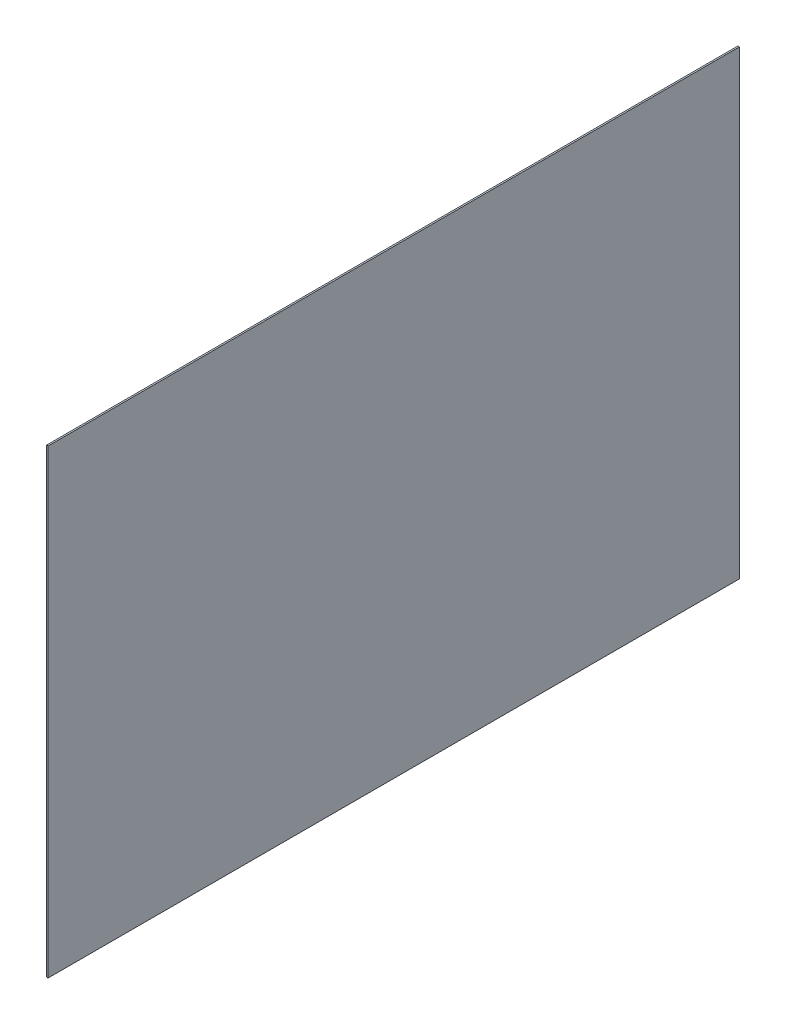
ISO-10303-21;
HEADER;
FILE_DESCRIPTION(('STEP AP214'),'2;1');
FILE_NAME('part.step','',(''),(''),'','','');
FILE_SCHEMA(('AUTOMOTIVE_DESIGN { 1 0 10303 214 1 1 1 1 }'));
ENDSEC;
DATA;
#1=APPLICATION_CONTEXT('core data for automotive mechanical design processes');
#2=APPLICATION_PROTOCOL_DEFINITION('international standard','automotive_design',2000,#1);
#3=PRODUCT_CONTEXT('',#1,'mechanical');
#4=PRODUCT('Part','Part','',(#3));
#5=PRODUCT_RELATED_PRODUCT_CATEGORY('part','',(#4));
#6=PRODUCT_DEFINITION_FORMATION('','',#4);
#7=PRODUCT_DEFINITION_CONTEXT('part definition',#1,'design');
#8=PRODUCT_DEFINITION('design','',#6,#7);
#9=PRODUCT_DEFINITION_SHAPE('','',#8);
#10=(LENGTH_UNIT() NAMED_UNIT(*) SI_UNIT(.MILLI.,.METRE.));
#11=(NAMED_UNIT(*) PLANE_ANGLE_UNIT() SI_UNIT($,.RADIAN.));
#12=(NAMED_UNIT(*) SI_UNIT($,.STERADIAN.) SOLID_ANGLE_UNIT());
#13=UNCERTAINTY_MEASURE_WITH_UNIT(LENGTH_MEASURE(1.E-05),#10,'distance_accuracy_value','');
#14=(GEOMETRIC_REPRESENTATION_CONTEXT(3) GLOBAL_UNCERTAINTY_ASSIGNED_CONTEXT((#13)) GLOBAL_UNIT_ASSIGNED_CONTEXT((#10,
#11,#12)) REPRESENTATION_CONTEXT('',''));
#15=CARTESIAN_POINT('',(0.,0.,0.));
#16=DIRECTION('',(0.,0.,1.));
#17=DIRECTION('',(1.,0.,0.));
#18=AXIS2_PLACEMENT_3D('',#15,#16,#17);
#19=CARTESIAN_POINT('',(1.,150.,-225.));
#20=DIRECTION('',(0.,0.,1.));
#21=DIRECTION('',(1.,0.,0.));
#22=AXIS2_PLACEMENT_3D('',#19,#20,#21);
#23=PLANE('',#22);
#24=DIRECTION('',(0.,1.,0.));
#25=VECTOR('',#24,1.);
#26=CARTESIAN_POINT('',(0.,150.,-225.));
#27=LINE('',#26,#25);
#28=CARTESIAN_POINT('',(0.,-150.,-225.));
#29=VERTEX_POINT('',#28);
#30=CARTESIAN_POINT('',(0.,150.,-225.));
#31=VERTEX_POINT('',#30);
#32=EDGE_CURVE('E95',#29,#31,#27,.T.);
#33=ORIENTED_EDGE('',*,*,#32,.T.);
#34=DIRECTION('',(-1.,0.,0.));
#35=VECTOR('',#34,1.);
#36=CARTESIAN_POINT('',(1.,150.,-225.));
#37=LINE('',#36,#35);
#38=CARTESIAN_POINT('',(1.,150.,-225.));
#39=VERTEX_POINT('',#38);
#40=EDGE_CURVE('E11',#39,#31,#37,.T.);
#41=ORIENTED_EDGE('',*,*,#40,.F.);
#42=DIRECTION('',(0.,1.,0.));
#43=VECTOR('',#42,1.);
#44=CARTESIAN_POINT('',(1.,150.,-225.));
#45=LINE('',#44,#43);
#46=CARTESIAN_POINT('',(1.,-150.,-225.));
#47=VERTEX_POINT('',#46);
#48=EDGE_CURVE('E83',#47,#39,#45,.T.);
#49=ORIENTED_EDGE('',*,*,#48,.F.);
#50=DIRECTION('',(-1.,0.,0.));
#51=VECTOR('',#50,1.);
#52=CARTESIAN_POINT('',(1.,-150.,-225.));
#53=LINE('',#52,#51);
#54=EDGE_CURVE('E91',#47,#29,#53,.T.);
#55=ORIENTED_EDGE('',*,*,#54,.T.);
#56=EDGE_LOOP('',(#33,#41,#49,#55));
#57=FACE_BOUND('',#56,.T.);
#58=ADVANCED_FACE('F32',(#57),#23,.F.);
#59=CARTESIAN_POINT('',(1.,150.,225.));
#60=DIRECTION('',(0.,-1.,0.));
#61=DIRECTION('',(0.,0.,-1.));
#62=AXIS2_PLACEMENT_3D('',#59,#60,#61);
#63=PLANE('',#62);
#64=DIRECTION('',(0.,0.,1.));
#65=VECTOR('',#64,1.);
#66=CARTESIAN_POINT('',(0.,150.,225.));
#67=LINE('',#66,#65);
#68=CARTESIAN_POINT('',(0.,150.,225.));
#69=VERTEX_POINT('',#68);
#70=EDGE_CURVE('E87',#31,#69,#67,.T.);
#71=ORIENTED_EDGE('',*,*,#70,.T.);
#72=DIRECTION('',(-1.,0.,0.));
#73=VECTOR('',#72,1.);
#74=CARTESIAN_POINT('',(1.,150.,225.));
#75=LINE('',#74,#73);
#76=CARTESIAN_POINT('',(1.,150.,225.));
#77=VERTEX_POINT('',#76);
#78=EDGE_CURVE('E40',#77,#69,#75,.T.);
#79=ORIENTED_EDGE('',*,*,#78,.F.);
#80=DIRECTION('',(0.,0.,1.));
#81=VECTOR('',#80,1.);
#82=CARTESIAN_POINT('',(1.,150.,225.));
#83=LINE('',#82,#81);
#84=EDGE_CURVE('E78',#39,#77,#83,.T.);
#85=ORIENTED_EDGE('',*,*,#84,.F.);
#86=ORIENTED_EDGE('',*,*,#40,.T.);
#87=EDGE_LOOP('',(#71,#79,#85,#86));
#88=FACE_BOUND('',#87,.T.);
#89=ADVANCED_FACE('F86',(#88),#63,.F.);
#90=CARTESIAN_POINT('',(1.,150.,225.));
#91=DIRECTION('',(0.,0.,-1.));
#92=DIRECTION('',(0.,1.,0.));
#93=AXIS2_PLACEMENT_3D('',#90,#91,#92);
#94=PLANE('',#93);
#95=DIRECTION('',(0.,-1.,0.));
#96=VECTOR('',#95,1.);
#97=CARTESIAN_POINT('',(0.,150.,225.));
#98=LINE('',#97,#96);
#99=CARTESIAN_POINT('',(0.,-150.,225.));
#100=VERTEX_POINT('',#99);
#101=EDGE_CURVE('E65',#69,#100,#98,.T.);
#102=ORIENTED_EDGE('',*,*,#101,.T.);
#103=DIRECTION('',(-1.,0.,0.));
#104=VECTOR('',#103,1.);
#105=CARTESIAN_POINT('',(1.,-150.,225.));
#106=LINE('',#105,#104);
#107=CARTESIAN_POINT('',(1.,-150.,225.));
#108=VERTEX_POINT('',#107);
#109=EDGE_CURVE('E88',#108,#100,#106,.T.);
#110=ORIENTED_EDGE('',*,*,#109,.F.);
#111=DIRECTION('',(0.,-1.,0.));
#112=VECTOR('',#111,1.);
#113=CARTESIAN_POINT('',(1.,150.,225.));
#114=LINE('',#113,#112);
#115=EDGE_CURVE('E81',#77,#108,#114,.T.);
#116=ORIENTED_EDGE('',*,*,#115,.F.);
#117=ORIENTED_EDGE('',*,*,#78,.T.);
#118=EDGE_LOOP('',(#102,#110,#116,#117));
#119=FACE_BOUND('',#118,.T.);
#120=ADVANCED_FACE('F89',(#119),#94,.F.);
#121=CARTESIAN_POINT('',(1.,-150.,225.));
#122=DIRECTION('',(0.,1.,0.));
#123=DIRECTION('',(0.,0.,1.));
#124=AXIS2_PLACEMENT_3D('',#121,#122,#123);
#125=PLANE('',#124);
#126=DIRECTION('',(0.,0.,-1.));
#127=VECTOR('',#126,1.);
#128=CARTESIAN_POINT('',(0.,-150.,225.));
#129=LINE('',#128,#127);
#130=EDGE_CURVE('E71',#100,#29,#129,.T.);
#131=ORIENTED_EDGE('',*,*,#130,.T.);
#132=ORIENTED_EDGE('',*,*,#54,.F.);
#133=DIRECTION('',(0.,0.,-1.));
#134=VECTOR('',#133,1.);
#135=CARTESIAN_POINT('',(1.,-150.,225.));
#136=LINE('',#135,#134);
#137=EDGE_CURVE('E48',#108,#47,#136,.T.);
#138=ORIENTED_EDGE('',*,*,#137,.F.);
#139=ORIENTED_EDGE('',*,*,#109,.T.);
#140=EDGE_LOOP('',(#131,#132,#138,#139));
#141=FACE_BOUND('',#140,.T.);
#142=ADVANCED_FACE('F102',(#141),#125,.F.);
#143=CARTESIAN_POINT('',(1.,0.,0.));
#144=DIRECTION('',(1.,0.,0.));
#145=DIRECTION('',(0.,0.,-1.));
#146=AXIS2_PLACEMENT_3D('',#143,#144,#145);
#147=PLANE('',#146);
#148=ORIENTED_EDGE('',*,*,#48,.T.);
#149=ORIENTED_EDGE('',*,*,#84,.T.);
#150=ORIENTED_EDGE('',*,*,#115,.T.);
#151=ORIENTED_EDGE('',*,*,#137,.T.);
#152=EDGE_LOOP('',(#148,#149,#150,#151));
#153=FACE_BOUND('',#152,.T.);
#154=ADVANCED_FACE('F79',(#153),#147,.T.);
#155=CARTESIAN_POINT('',(0.,0.,0.));
#156=DIRECTION('',(1.,0.,0.));
#157=DIRECTION('',(0.,0.,-1.));
#158=AXIS2_PLACEMENT_3D('',#155,#156,#157);
#159=PLANE('',#158);
#160=ORIENTED_EDGE('',*,*,#32,.F.);
#161=ORIENTED_EDGE('',*,*,#130,.F.);
#162=ORIENTED_EDGE('',*,*,#101,.F.);
#163=ORIENTED_EDGE('',*,*,#70,.F.);
#164=EDGE_LOOP('',(#160,#161,#162,#163));
#165=FACE_BOUND('',#164,.T.);
#166=ADVANCED_FACE('F105',(#165),#159,.F.);
#167=CLOSED_SHELL('',(#58,#89,#120,#142,#154,#166));
#168=MANIFOLD_SOLID_BREP('B2',#167);
#169=ADVANCED_BREP_SHAPE_REPRESENTATION('',(#18,#168),#14);
#170=SHAPE_DEFINITION_REPRESENTATION(#9,#169);
ENDSEC;
END-ISO-10303-21;
